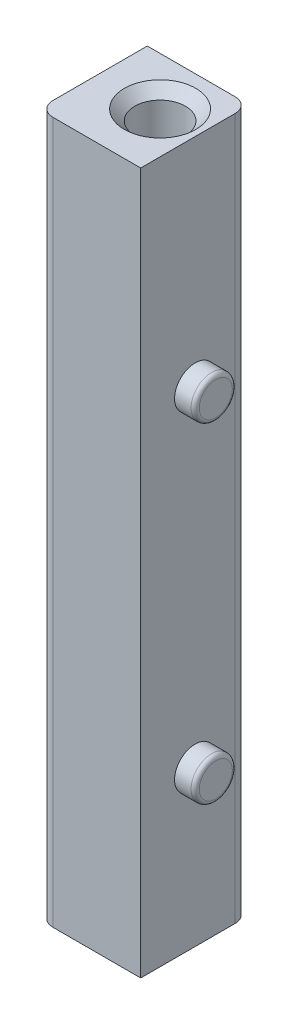
ISO-10303-21;
HEADER;
FILE_DESCRIPTION(('STEP AP214'),'2;1');
FILE_NAME('part.step','',(''),(''),'','','');
FILE_SCHEMA(('AUTOMOTIVE_DESIGN { 1 0 10303 214 1 1 1 1 }'));
ENDSEC;
DATA;
#1=APPLICATION_CONTEXT('core data for automotive mechanical design processes');
#2=APPLICATION_PROTOCOL_DEFINITION('international standard','automotive_design',2000,#1);
#3=PRODUCT_CONTEXT('',#1,'mechanical');
#4=PRODUCT('Part','Part','',(#3));
#5=PRODUCT_RELATED_PRODUCT_CATEGORY('part','',(#4));
#6=PRODUCT_DEFINITION_FORMATION('','',#4);
#7=PRODUCT_DEFINITION_CONTEXT('part definition',#1,'design');
#8=PRODUCT_DEFINITION('design','',#6,#7);
#9=PRODUCT_DEFINITION_SHAPE('','',#8);
#10=(LENGTH_UNIT() NAMED_UNIT(*) SI_UNIT(.MILLI.,.METRE.));
#11=(NAMED_UNIT(*) PLANE_ANGLE_UNIT() SI_UNIT($,.RADIAN.));
#12=(NAMED_UNIT(*) SI_UNIT($,.STERADIAN.) SOLID_ANGLE_UNIT());
#13=UNCERTAINTY_MEASURE_WITH_UNIT(LENGTH_MEASURE(1.E-05),#10,'distance_accuracy_value','');
#14=(GEOMETRIC_REPRESENTATION_CONTEXT(3) GLOBAL_UNCERTAINTY_ASSIGNED_CONTEXT((#13)) GLOBAL_UNIT_ASSIGNED_CONTEXT((#10,
#11,#12)) REPRESENTATION_CONTEXT('',''));
#15=CARTESIAN_POINT('',(0.,0.,0.));
#16=DIRECTION('',(0.,0.,1.));
#17=DIRECTION('',(1.,0.,0.));
#18=AXIS2_PLACEMENT_3D('',#15,#16,#17);
#19=CARTESIAN_POINT('',(5.1054,-39.37,-5.9182));
#20=DIRECTION('',(1.,0.,0.));
#21=DIRECTION('',(0.,0.,-1.));
#22=AXIS2_PLACEMENT_3D('',#19,#20,#21);
#23=PLANE('',#22);
#24=CARTESIAN_POINT('',(5.1054,20.32,0.787400000000002));
#25=DIRECTION('',(1.,0.,0.));
#26=DIRECTION('',(0.,0.,-1.));
#27=AXIS2_PLACEMENT_3D('',#24,#25,#26);
#28=CIRCLE('',#27,2.54);
#29=CARTESIAN_POINT('',(5.1054,20.32,-1.7526));
#30=VERTEX_POINT('',#29);
#31=EDGE_CURVE('E131',#30,#30,#28,.T.);
#32=ORIENTED_EDGE('',*,*,#31,.F.);
#33=EDGE_LOOP('',(#32));
#34=FACE_BOUND('',#33,.T.);
#35=DIRECTION('',(0.,0.,-1.));
#36=VECTOR('',#35,1.);
#37=CARTESIAN_POINT('',(5.1054,-39.37,-5.9182));
#38=LINE('',#37,#36);
#39=CARTESIAN_POINT('',(5.1054,-39.37,7.493));
#40=VERTEX_POINT('',#39);
#41=CARTESIAN_POINT('',(5.1054,-39.37,-4.1402));
#42=VERTEX_POINT('',#41);
#43=EDGE_CURVE('E120',#40,#42,#38,.T.);
#44=ORIENTED_EDGE('',*,*,#43,.T.);
#45=DIRECTION('',(0.,1.,0.));
#46=VECTOR('',#45,1.);
#47=CARTESIAN_POINT('',(5.1054,-39.37,-4.1402));
#48=LINE('',#47,#46);
#49=CARTESIAN_POINT('',(5.1054,46.99,-4.1402));
#50=VERTEX_POINT('',#49);
#51=EDGE_CURVE('E110',#42,#50,#48,.T.);
#52=ORIENTED_EDGE('',*,*,#51,.T.);
#53=DIRECTION('',(0.,0.,-1.));
#54=VECTOR('',#53,1.);
#55=CARTESIAN_POINT('',(5.1054,46.99,-5.9182));
#56=LINE('',#55,#54);
#57=CARTESIAN_POINT('',(5.1054,46.99,7.493));
#58=VERTEX_POINT('',#57);
#59=EDGE_CURVE('E92',#58,#50,#56,.T.);
#60=ORIENTED_EDGE('',*,*,#59,.F.);
#61=DIRECTION('',(0.,1.,0.));
#62=VECTOR('',#61,1.);
#63=CARTESIAN_POINT('',(5.1054,-39.37,7.493));
#64=LINE('',#63,#62);
#65=EDGE_CURVE('E99',#40,#58,#64,.T.);
#66=ORIENTED_EDGE('',*,*,#65,.F.);
#67=EDGE_LOOP('',(#44,#52,#60,#66));
#68=FACE_BOUND('',#67,.T.);
#69=CARTESIAN_POINT('',(5.1054,-20.32,0.787400000000002));
#70=DIRECTION('',(1.,0.,0.));
#71=DIRECTION('',(0.,0.,-1.));
#72=AXIS2_PLACEMENT_3D('',#69,#70,#71);
#73=CIRCLE('',#72,2.54);
#74=CARTESIAN_POINT('',(5.1054,-20.32,-1.7526));
#75=VERTEX_POINT('',#74);
#76=EDGE_CURVE('E206',#75,#75,#73,.T.);
#77=ORIENTED_EDGE('',*,*,#76,.F.);
#78=EDGE_LOOP('',(#77));
#79=FACE_BOUND('',#78,.T.);
#80=ADVANCED_FACE('F32',(#34,#68,#79),#23,.T.);
#81=CARTESIAN_POINT('',(-7.493,-39.37,-5.9182));
#82=DIRECTION('',(-1.,0.,0.));
#83=DIRECTION('',(0.,0.,1.));
#84=AXIS2_PLACEMENT_3D('',#81,#82,#83);
#85=PLANE('',#84);
#86=DIRECTION('',(0.,0.,1.));
#87=VECTOR('',#86,1.);
#88=CARTESIAN_POINT('',(-7.493,-39.37,-5.9182));
#89=LINE('',#88,#87);
#90=CARTESIAN_POINT('',(-7.493,-39.37,-5.9182));
#91=VERTEX_POINT('',#90);
#92=CARTESIAN_POINT('',(-7.493,-39.37,5.715));
#93=VERTEX_POINT('',#92);
#94=EDGE_CURVE('E113',#91,#93,#89,.T.);
#95=ORIENTED_EDGE('',*,*,#94,.T.);
#96=DIRECTION('',(0.,1.,0.));
#97=VECTOR('',#96,1.);
#98=CARTESIAN_POINT('',(-7.493,-39.37,5.715));
#99=LINE('',#98,#97);
#100=CARTESIAN_POINT('',(-7.493,46.99,5.715));
#101=VERTEX_POINT('',#100);
#102=EDGE_CURVE('E140',#93,#101,#99,.T.);
#103=ORIENTED_EDGE('',*,*,#102,.T.);
#104=DIRECTION('',(0.,0.,1.));
#105=VECTOR('',#104,1.);
#106=CARTESIAN_POINT('',(-7.493,46.99,-5.9182));
#107=LINE('',#106,#105);
#108=CARTESIAN_POINT('',(-7.493,46.99,-5.9182));
#109=VERTEX_POINT('',#108);
#110=EDGE_CURVE('E96',#109,#101,#107,.T.);
#111=ORIENTED_EDGE('',*,*,#110,.F.);
#112=DIRECTION('',(0.,1.,0.));
#113=VECTOR('',#112,1.);
#114=CARTESIAN_POINT('',(-7.493,-39.37,-5.9182));
#115=LINE('',#114,#113);
#116=EDGE_CURVE('E104',#91,#109,#115,.T.);
#117=ORIENTED_EDGE('',*,*,#116,.F.);
#118=EDGE_LOOP('',(#95,#103,#111,#117));
#119=FACE_BOUND('',#118,.T.);
#120=ADVANCED_FACE('F168',(#119),#85,.T.);
#121=CARTESIAN_POINT('',(-7.493,-39.37,-5.9182));
#122=DIRECTION('',(0.,0.,-1.));
#123=DIRECTION('',(-1.,0.,0.));
#124=AXIS2_PLACEMENT_3D('',#121,#122,#123);
#125=PLANE('',#124);
#126=DIRECTION('',(-1.,0.,0.));
#127=VECTOR('',#126,1.);
#128=CARTESIAN_POINT('',(-7.493,46.99,-5.9182));
#129=LINE('',#128,#127);
#130=CARTESIAN_POINT('',(3.3274,46.99,-5.9182));
#131=VERTEX_POINT('',#130);
#132=EDGE_CURVE('E111',#131,#109,#129,.T.);
#133=ORIENTED_EDGE('',*,*,#132,.F.);
#134=DIRECTION('',(0.,1.,0.));
#135=VECTOR('',#134,1.);
#136=CARTESIAN_POINT('',(3.3274,-39.37,-5.9182));
#137=LINE('',#136,#135);
#138=CARTESIAN_POINT('',(3.3274,-39.37,-5.9182));
#139=VERTEX_POINT('',#138);
#140=EDGE_CURVE('E55',#131,#139,#137,.F.);
#141=ORIENTED_EDGE('',*,*,#140,.T.);
#142=DIRECTION('',(-1.,0.,0.));
#143=VECTOR('',#142,1.);
#144=CARTESIAN_POINT('',(-7.493,-39.37,-5.9182));
#145=LINE('',#144,#143);
#146=EDGE_CURVE('E105',#139,#91,#145,.T.);
#147=ORIENTED_EDGE('',*,*,#146,.T.);
#148=ORIENTED_EDGE('',*,*,#116,.T.);
#149=EDGE_LOOP('',(#133,#141,#147,#148));
#150=FACE_BOUND('',#149,.T.);
#151=ADVANCED_FACE('F174',(#150),#125,.T.);
#152=CARTESIAN_POINT('',(-7.493,-39.37,7.493));
#153=DIRECTION('',(0.,0.,1.));
#154=DIRECTION('',(1.,0.,0.));
#155=AXIS2_PLACEMENT_3D('',#152,#153,#154);
#156=PLANE('',#155);
#157=DIRECTION('',(1.,0.,0.));
#158=VECTOR('',#157,1.);
#159=CARTESIAN_POINT('',(-7.493,46.99,7.493));
#160=LINE('',#159,#158);
#161=CARTESIAN_POINT('',(-5.715,46.99,7.493));
#162=VERTEX_POINT('',#161);
#163=EDGE_CURVE('E87',#162,#58,#160,.T.);
#164=ORIENTED_EDGE('',*,*,#163,.F.);
#165=DIRECTION('',(0.,1.,0.));
#166=VECTOR('',#165,1.);
#167=CARTESIAN_POINT('',(-5.715,-39.37,7.493));
#168=LINE('',#167,#166);
#169=CARTESIAN_POINT('',(-5.715,-39.37,7.493));
#170=VERTEX_POINT('',#169);
#171=EDGE_CURVE('E146',#162,#170,#168,.F.);
#172=ORIENTED_EDGE('',*,*,#171,.T.);
#173=DIRECTION('',(1.,0.,0.));
#174=VECTOR('',#173,1.);
#175=CARTESIAN_POINT('',(-7.493,-39.37,7.493));
#176=LINE('',#175,#174);
#177=EDGE_CURVE('E102',#170,#40,#176,.T.);
#178=ORIENTED_EDGE('',*,*,#177,.T.);
#179=ORIENTED_EDGE('',*,*,#65,.T.);
#180=EDGE_LOOP('',(#164,#172,#178,#179));
#181=FACE_BOUND('',#180,.T.);
#182=ADVANCED_FACE('F100',(#181),#156,.T.);
#183=CARTESIAN_POINT('',(-7.493,-39.37,7.493));
#184=DIRECTION('',(0.,1.,0.));
#185=DIRECTION('',(0.,0.,1.));
#186=AXIS2_PLACEMENT_3D('',#183,#184,#185);
#187=PLANE('',#186);
#188=CARTESIAN_POINT('',(0.,-39.37,0.));
#189=DIRECTION('',(0.,1.,0.));
#190=DIRECTION('',(0.,0.,1.));
#191=AXIS2_PLACEMENT_3D('',#188,#189,#190);
#192=CIRCLE('',#191,3.1242);
#193=CARTESIAN_POINT('',(0.,-39.37,3.1242));
#194=VERTEX_POINT('',#193);
#195=EDGE_CURVE('E204',#194,#194,#192,.T.);
#196=ORIENTED_EDGE('',*,*,#195,.T.);
#197=EDGE_LOOP('',(#196));
#198=FACE_BOUND('',#197,.T.);
#199=ORIENTED_EDGE('',*,*,#177,.F.);
#200=CARTESIAN_POINT('',(-5.715,-39.37,5.715));
#201=DIRECTION('',(0.,1.,0.));
#202=DIRECTION('',(0.,0.,1.));
#203=AXIS2_PLACEMENT_3D('',#200,#201,#202);
#204=CIRCLE('',#203,1.778);
#205=EDGE_CURVE('E149',#170,#93,#204,.F.);
#206=ORIENTED_EDGE('',*,*,#205,.T.);
#207=ORIENTED_EDGE('',*,*,#94,.F.);
#208=ORIENTED_EDGE('',*,*,#146,.F.);
#209=CARTESIAN_POINT('',(3.3274,-39.37,-4.1402));
#210=DIRECTION('',(0.,1.,0.));
#211=DIRECTION('',(0.,0.,1.));
#212=AXIS2_PLACEMENT_3D('',#209,#210,#211);
#213=CIRCLE('',#212,1.778);
#214=EDGE_CURVE('E47',#139,#42,#213,.F.);
#215=ORIENTED_EDGE('',*,*,#214,.T.);
#216=ORIENTED_EDGE('',*,*,#43,.F.);
#217=EDGE_LOOP('',(#199,#206,#207,#208,#215,#216));
#218=FACE_BOUND('',#217,.T.);
#219=ADVANCED_FACE('F182',(#198,#218),#187,.F.);
#220=CARTESIAN_POINT('',(-7.493,46.99,7.493));
#221=DIRECTION('',(0.,1.,0.));
#222=DIRECTION('',(0.,0.,1.));
#223=AXIS2_PLACEMENT_3D('',#220,#221,#222);
#224=PLANE('',#223);
#225=CARTESIAN_POINT('',(0.,46.99,0.));
#226=DIRECTION('',(0.,1.,0.));
#227=DIRECTION('',(0.,0.,1.));
#228=AXIS2_PLACEMENT_3D('',#225,#226,#227);
#229=CIRCLE('',#228,4.39419999999997);
#230=CARTESIAN_POINT('',(0.,46.99,4.39419999999997));
#231=VERTEX_POINT('',#230);
#232=EDGE_CURVE('E11',#231,#231,#229,.F.);
#233=ORIENTED_EDGE('',*,*,#232,.T.);
#234=EDGE_LOOP('',(#233));
#235=FACE_BOUND('',#234,.T.);
#236=ORIENTED_EDGE('',*,*,#110,.T.);
#237=CARTESIAN_POINT('',(-5.715,46.99,5.715));
#238=DIRECTION('',(0.,1.,0.));
#239=DIRECTION('',(0.,0.,1.));
#240=AXIS2_PLACEMENT_3D('',#237,#238,#239);
#241=CIRCLE('',#240,1.778);
#242=EDGE_CURVE('E93',#101,#162,#241,.T.);
#243=ORIENTED_EDGE('',*,*,#242,.T.);
#244=ORIENTED_EDGE('',*,*,#163,.T.);
#245=ORIENTED_EDGE('',*,*,#59,.T.);
#246=CARTESIAN_POINT('',(3.3274,46.99,-4.1402));
#247=DIRECTION('',(0.,1.,0.));
#248=DIRECTION('',(0.,0.,1.));
#249=AXIS2_PLACEMENT_3D('',#246,#247,#248);
#250=CIRCLE('',#249,1.778);
#251=EDGE_CURVE('E143',#50,#131,#250,.T.);
#252=ORIENTED_EDGE('',*,*,#251,.T.);
#253=ORIENTED_EDGE('',*,*,#132,.T.);
#254=EDGE_LOOP('',(#236,#243,#244,#245,#252,#253));
#255=FACE_BOUND('',#254,.T.);
#256=ADVANCED_FACE('F90',(#235,#255),#224,.T.);
#257=CARTESIAN_POINT('',(0.,-39.37,0.));
#258=DIRECTION('',(0.,1.,0.));
#259=DIRECTION('',(0.,0.,1.));
#260=AXIS2_PLACEMENT_3D('',#257,#258,#259);
#261=CYLINDRICAL_SURFACE('',#260,3.1242);
#262=CARTESIAN_POINT('',(0.,45.72,0.));
#263=DIRECTION('',(0.,1.,0.));
#264=DIRECTION('',(0.,0.,1.));
#265=AXIS2_PLACEMENT_3D('',#262,#263,#264);
#266=CIRCLE('',#265,3.1242);
#267=CARTESIAN_POINT('',(0.,45.72,3.1242));
#268=VERTEX_POINT('',#267);
#269=EDGE_CURVE('E40',#268,#268,#266,.T.);
#270=ORIENTED_EDGE('',*,*,#269,.T.);
#271=EDGE_LOOP('',(#270));
#272=FACE_BOUND('',#271,.T.);
#273=ORIENTED_EDGE('',*,*,#195,.F.);
#274=EDGE_LOOP('',(#273));
#275=FACE_BOUND('',#274,.T.);
#276=ADVANCED_FACE('F155',(#272,#275),#261,.F.);
#277=CARTESIAN_POINT('',(7.6454,-20.32,0.787400000000002));
#278=DIRECTION('',(-1.,0.,0.));
#279=DIRECTION('',(0.,0.,1.));
#280=AXIS2_PLACEMENT_3D('',#277,#278,#279);
#281=CYLINDRICAL_SURFACE('',#280,2.54);
#282=CARTESIAN_POINT('',(7.1374,-20.32,0.787400000000002));
#283=DIRECTION('',(1.,0.,0.));
#284=DIRECTION('',(0.,0.,-1.));
#285=AXIS2_PLACEMENT_3D('',#282,#283,#284);
#286=CIRCLE('',#285,2.54);
#287=CARTESIAN_POINT('',(7.1374,-20.32,-1.7526));
#288=VERTEX_POINT('',#287);
#289=EDGE_CURVE('E128',#288,#288,#286,.F.);
#290=ORIENTED_EDGE('',*,*,#289,.T.);
#291=EDGE_LOOP('',(#290));
#292=FACE_BOUND('',#291,.T.);
#293=ORIENTED_EDGE('',*,*,#76,.T.);
#294=EDGE_LOOP('',(#293));
#295=FACE_BOUND('',#294,.T.);
#296=ADVANCED_FACE('F212',(#292,#295),#281,.T.);
#297=CARTESIAN_POINT('',(7.6454,-20.32,0.787400000000002));
#298=DIRECTION('',(1.,0.,0.));
#299=DIRECTION('',(0.,0.,-1.));
#300=AXIS2_PLACEMENT_3D('',#297,#298,#299);
#301=PLANE('',#300);
#302=CARTESIAN_POINT('',(7.6454,-20.32,0.787400000000002));
#303=DIRECTION('',(1.,0.,0.));
#304=DIRECTION('',(0.,0.,-1.));
#305=AXIS2_PLACEMENT_3D('',#302,#303,#304);
#306=CIRCLE('',#305,2.032);
#307=CARTESIAN_POINT('',(7.6454,-20.32,-1.2446));
#308=VERTEX_POINT('',#307);
#309=EDGE_CURVE('E124',#308,#308,#306,.T.);
#310=ORIENTED_EDGE('',*,*,#309,.T.);
#311=EDGE_LOOP('',(#310));
#312=FACE_BOUND('',#311,.T.);
#313=ADVANCED_FACE('F188',(#312),#301,.T.);
#314=CARTESIAN_POINT('',(7.1374,-20.32,0.787400000000002));
#315=DIRECTION('',(1.,0.,0.));
#316=DIRECTION('',(0.,0.,-1.));
#317=AXIS2_PLACEMENT_3D('',#314,#315,#316);
#318=TOROIDAL_SURFACE('',#317,2.032,0.508);
#319=ORIENTED_EDGE('',*,*,#289,.F.);
#320=EDGE_LOOP('',(#319));
#321=FACE_BOUND('',#320,.T.);
#322=ORIENTED_EDGE('',*,*,#309,.F.);
#323=EDGE_LOOP('',(#322));
#324=FACE_BOUND('',#323,.T.);
#325=ADVANCED_FACE('F184',(#321,#324),#318,.T.);
#326=CARTESIAN_POINT('',(7.6454,20.32,0.787400000000002));
#327=DIRECTION('',(-1.,0.,0.));
#328=DIRECTION('',(0.,0.,1.));
#329=AXIS2_PLACEMENT_3D('',#326,#327,#328);
#330=CYLINDRICAL_SURFACE('',#329,2.54);
#331=CARTESIAN_POINT('',(7.1374,20.32,0.787400000000002));
#332=DIRECTION('',(1.,0.,0.));
#333=DIRECTION('',(0.,0.,-1.));
#334=AXIS2_PLACEMENT_3D('',#331,#332,#333);
#335=CIRCLE('',#334,2.54);
#336=CARTESIAN_POINT('',(7.1374,20.32,-1.7526));
#337=VERTEX_POINT('',#336);
#338=EDGE_CURVE('E134',#337,#337,#335,.F.);
#339=ORIENTED_EDGE('',*,*,#338,.T.);
#340=EDGE_LOOP('',(#339));
#341=FACE_BOUND('',#340,.T.);
#342=ORIENTED_EDGE('',*,*,#31,.T.);
#343=EDGE_LOOP('',(#342));
#344=FACE_BOUND('',#343,.T.);
#345=ADVANCED_FACE('F187',(#341,#344),#330,.T.);
#346=CARTESIAN_POINT('',(7.6454,20.32,0.787400000000002));
#347=DIRECTION('',(1.,0.,0.));
#348=DIRECTION('',(0.,0.,-1.));
#349=AXIS2_PLACEMENT_3D('',#346,#347,#348);
#350=PLANE('',#349);
#351=CARTESIAN_POINT('',(7.6454,20.32,0.787400000000002));
#352=DIRECTION('',(1.,0.,0.));
#353=DIRECTION('',(0.,0.,-1.));
#354=AXIS2_PLACEMENT_3D('',#351,#352,#353);
#355=CIRCLE('',#354,2.032);
#356=CARTESIAN_POINT('',(7.6454,20.32,-1.2446));
#357=VERTEX_POINT('',#356);
#358=EDGE_CURVE('E137',#357,#357,#355,.T.);
#359=ORIENTED_EDGE('',*,*,#358,.T.);
#360=EDGE_LOOP('',(#359));
#361=FACE_BOUND('',#360,.T.);
#362=ADVANCED_FACE('F193',(#361),#350,.T.);
#363=CARTESIAN_POINT('',(7.1374,20.32,0.787400000000002));
#364=DIRECTION('',(1.,0.,0.));
#365=DIRECTION('',(0.,0.,-1.));
#366=AXIS2_PLACEMENT_3D('',#363,#364,#365);
#367=TOROIDAL_SURFACE('',#366,2.032,0.508);
#368=ORIENTED_EDGE('',*,*,#358,.F.);
#369=EDGE_LOOP('',(#368));
#370=FACE_BOUND('',#369,.T.);
#371=ORIENTED_EDGE('',*,*,#338,.F.);
#372=EDGE_LOOP('',(#371));
#373=FACE_BOUND('',#372,.T.);
#374=ADVANCED_FACE('F190',(#370,#373),#367,.T.);
#375=CARTESIAN_POINT('',(-5.715,-39.37,5.715));
#376=DIRECTION('',(0.,1.,0.));
#377=DIRECTION('',(0.,0.,1.));
#378=AXIS2_PLACEMENT_3D('',#375,#376,#377);
#379=CYLINDRICAL_SURFACE('',#378,1.778);
#380=ORIENTED_EDGE('',*,*,#205,.F.);
#381=ORIENTED_EDGE('',*,*,#171,.F.);
#382=ORIENTED_EDGE('',*,*,#242,.F.);
#383=ORIENTED_EDGE('',*,*,#102,.F.);
#384=EDGE_LOOP('',(#380,#381,#382,#383));
#385=FACE_BOUND('',#384,.T.);
#386=ADVANCED_FACE('F164',(#385),#379,.T.);
#387=CARTESIAN_POINT('',(3.3274,-39.37,-4.1402));
#388=DIRECTION('',(0.,1.,0.));
#389=DIRECTION('',(0.,0.,1.));
#390=AXIS2_PLACEMENT_3D('',#387,#388,#389);
#391=CYLINDRICAL_SURFACE('',#390,1.778);
#392=ORIENTED_EDGE('',*,*,#214,.F.);
#393=ORIENTED_EDGE('',*,*,#140,.F.);
#394=ORIENTED_EDGE('',*,*,#251,.F.);
#395=ORIENTED_EDGE('',*,*,#51,.F.);
#396=EDGE_LOOP('',(#392,#393,#394,#395));
#397=FACE_BOUND('',#396,.T.);
#398=ADVANCED_FACE('F159',(#397),#391,.T.);
#399=CARTESIAN_POINT('',(0.,45.72,0.));
#400=DIRECTION('',(0.,1.,0.));
#401=DIRECTION('',(0.,0.,1.));
#402=AXIS2_PLACEMENT_3D('',#399,#400,#401);
#403=CONICAL_SURFACE('',#402,3.1242,0.785398163397451);
#404=ORIENTED_EDGE('',*,*,#232,.F.);
#405=EDGE_LOOP('',(#404));
#406=FACE_BOUND('',#405,.T.);
#407=ORIENTED_EDGE('',*,*,#269,.F.);
#408=EDGE_LOOP('',(#407));
#409=FACE_BOUND('',#408,.T.);
#410=ADVANCED_FACE('F34',(#406,#409),#403,.F.);
#411=CLOSED_SHELL('',(#80,#120,#151,#182,#219,#256,#276,#296,#313,#325,#345,#362,#374,#386,#398,#410));
#412=MANIFOLD_SOLID_BREP('B2',#411);
#413=ADVANCED_BREP_SHAPE_REPRESENTATION('',(#18,#412),#14);
#414=SHAPE_DEFINITION_REPRESENTATION(#9,#413);
ENDSEC;
END-ISO-10303-21;
